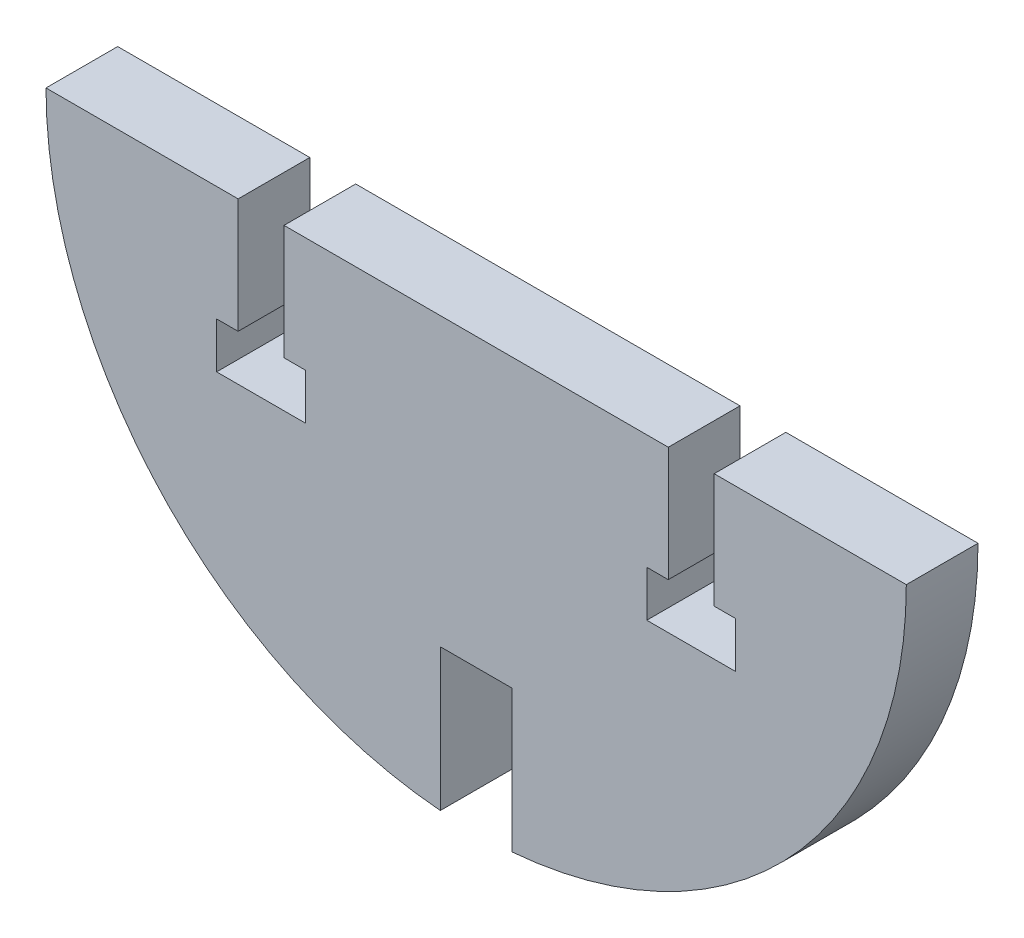
ISO-10303-21;
HEADER;
FILE_DESCRIPTION(('STEP AP214'),'2;1');
FILE_NAME('part.step','',(''),(''),'','','');
FILE_SCHEMA(('AUTOMOTIVE_DESIGN { 1 0 10303 214 1 1 1 1 }'));
ENDSEC;
DATA;
#1=APPLICATION_CONTEXT('core data for automotive mechanical design processes');
#2=APPLICATION_PROTOCOL_DEFINITION('international standard','automotive_design',2000,#1);
#3=PRODUCT_CONTEXT('',#1,'mechanical');
#4=PRODUCT('Part','Part','',(#3));
#5=PRODUCT_RELATED_PRODUCT_CATEGORY('part','',(#4));
#6=PRODUCT_DEFINITION_FORMATION('','',#4);
#7=PRODUCT_DEFINITION_CONTEXT('part definition',#1,'design');
#8=PRODUCT_DEFINITION('design','',#6,#7);
#9=PRODUCT_DEFINITION_SHAPE('','',#8);
#10=(LENGTH_UNIT() NAMED_UNIT(*) SI_UNIT(.MILLI.,.METRE.));
#11=(NAMED_UNIT(*) PLANE_ANGLE_UNIT() SI_UNIT($,.RADIAN.));
#12=(NAMED_UNIT(*) SI_UNIT($,.STERADIAN.) SOLID_ANGLE_UNIT());
#13=UNCERTAINTY_MEASURE_WITH_UNIT(LENGTH_MEASURE(1.E-05),#10,'distance_accuracy_value','');
#14=(GEOMETRIC_REPRESENTATION_CONTEXT(3) GLOBAL_UNCERTAINTY_ASSIGNED_CONTEXT((#13)) GLOBAL_UNIT_ASSIGNED_CONTEXT((#10,
#11,#12)) REPRESENTATION_CONTEXT('',''));
#15=CARTESIAN_POINT('',(0.,0.,0.));
#16=DIRECTION('',(0.,0.,1.));
#17=DIRECTION('',(1.,0.,0.));
#18=AXIS2_PLACEMENT_3D('',#15,#16,#17);
#19=CARTESIAN_POINT('',(-13.843,584.2,6.35));
#20=DIRECTION('',(1.,0.,0.));
#21=DIRECTION('',(0.,0.,-1.));
#22=AXIS2_PLACEMENT_3D('',#19,#20,#21);
#23=PLANE('',#22);
#24=DIRECTION('',(0.,-1.,0.));
#25=VECTOR('',#24,1.);
#26=CARTESIAN_POINT('',(-13.843,584.2,0.));
#27=LINE('',#26,#25);
#28=CARTESIAN_POINT('',(-13.843,584.2,0.));
#29=VERTEX_POINT('',#28);
#30=CARTESIAN_POINT('',(-13.843,574.04,0.));
#31=VERTEX_POINT('',#30);
#32=EDGE_CURVE('E214',#29,#31,#27,.T.);
#33=ORIENTED_EDGE('',*,*,#32,.T.);
#34=DIRECTION('',(0.,0.,-1.));
#35=VECTOR('',#34,1.);
#36=CARTESIAN_POINT('',(-13.843,574.04,6.35));
#37=LINE('',#36,#35);
#38=CARTESIAN_POINT('',(-13.843,574.04,6.35));
#39=VERTEX_POINT('',#38);
#40=EDGE_CURVE('E39',#39,#31,#37,.T.);
#41=ORIENTED_EDGE('',*,*,#40,.F.);
#42=DIRECTION('',(0.,-1.,0.));
#43=VECTOR('',#42,1.);
#44=CARTESIAN_POINT('',(-13.843,584.2,6.35));
#45=LINE('',#44,#43);
#46=CARTESIAN_POINT('',(-13.843,584.2,6.35));
#47=VERTEX_POINT('',#46);
#48=EDGE_CURVE('E133',#47,#39,#45,.T.);
#49=ORIENTED_EDGE('',*,*,#48,.F.);
#50=DIRECTION('',(0.,0.,-1.));
#51=VECTOR('',#50,1.);
#52=CARTESIAN_POINT('',(-13.843,584.2,6.35));
#53=LINE('',#52,#51);
#54=EDGE_CURVE('E11',#47,#29,#53,.T.);
#55=ORIENTED_EDGE('',*,*,#54,.T.);
#56=EDGE_LOOP('',(#33,#41,#49,#55));
#57=FACE_BOUND('',#56,.T.);
#58=ADVANCED_FACE('F31',(#57),#23,.F.);
#59=CARTESIAN_POINT('',(-13.843,574.04,6.35));
#60=DIRECTION('',(0.,1.,0.));
#61=DIRECTION('',(0.,0.,1.));
#62=AXIS2_PLACEMENT_3D('',#59,#60,#61);
#63=PLANE('',#62);
#64=DIRECTION('',(1.,0.,0.));
#65=VECTOR('',#64,1.);
#66=CARTESIAN_POINT('',(-13.843,574.04,0.));
#67=LINE('',#66,#65);
#68=CARTESIAN_POINT('',(-11.938,574.04,0.));
#69=VERTEX_POINT('',#68);
#70=EDGE_CURVE('E216',#31,#69,#67,.T.);
#71=ORIENTED_EDGE('',*,*,#70,.T.);
#72=DIRECTION('',(0.,0.,-1.));
#73=VECTOR('',#72,1.);
#74=CARTESIAN_POINT('',(-11.938,574.04,6.35));
#75=LINE('',#74,#73);
#76=CARTESIAN_POINT('',(-11.938,574.04,6.35));
#77=VERTEX_POINT('',#76);
#78=EDGE_CURVE('E307',#77,#69,#75,.T.);
#79=ORIENTED_EDGE('',*,*,#78,.F.);
#80=DIRECTION('',(1.,0.,0.));
#81=VECTOR('',#80,1.);
#82=CARTESIAN_POINT('',(-13.843,574.04,6.35));
#83=LINE('',#82,#81);
#84=EDGE_CURVE('E315',#39,#77,#83,.T.);
#85=ORIENTED_EDGE('',*,*,#84,.F.);
#86=ORIENTED_EDGE('',*,*,#40,.T.);
#87=EDGE_LOOP('',(#71,#79,#85,#86));
#88=FACE_BOUND('',#87,.T.);
#89=ADVANCED_FACE('F313',(#88),#63,.F.);
#90=CARTESIAN_POINT('',(-11.938,572.554033861209,6.35));
#91=DIRECTION('',(1.,0.,0.));
#92=DIRECTION('',(0.,0.,-1.));
#93=AXIS2_PLACEMENT_3D('',#90,#91,#92);
#94=PLANE('',#93);
#95=DIRECTION('',(0.,-1.,0.));
#96=VECTOR('',#95,1.);
#97=CARTESIAN_POINT('',(-11.938,572.554033861209,0.));
#98=LINE('',#97,#96);
#99=CARTESIAN_POINT('',(-11.938,569.976,0.));
#100=VERTEX_POINT('',#99);
#101=EDGE_CURVE('E219',#69,#100,#98,.T.);
#102=ORIENTED_EDGE('',*,*,#101,.T.);
#103=DIRECTION('',(0.,0.,-1.));
#104=VECTOR('',#103,1.);
#105=CARTESIAN_POINT('',(-11.938,569.976,6.35));
#106=LINE('',#105,#104);
#107=CARTESIAN_POINT('',(-11.938,569.976,6.35));
#108=VERTEX_POINT('',#107);
#109=EDGE_CURVE('E304',#108,#100,#106,.T.);
#110=ORIENTED_EDGE('',*,*,#109,.F.);
#111=DIRECTION('',(0.,-1.,0.));
#112=VECTOR('',#111,1.);
#113=CARTESIAN_POINT('',(-11.938,574.04,6.35));
#114=LINE('',#113,#112);
#115=EDGE_CURVE('E332',#77,#108,#114,.T.);
#116=ORIENTED_EDGE('',*,*,#115,.F.);
#117=ORIENTED_EDGE('',*,*,#78,.T.);
#118=EDGE_LOOP('',(#102,#110,#116,#117));
#119=FACE_BOUND('',#118,.T.);
#120=ADVANCED_FACE('F323',(#119),#94,.F.);
#121=CARTESIAN_POINT('',(-19.812,569.976,6.35));
#122=DIRECTION('',(0.,-1.,0.));
#123=DIRECTION('',(0.,0.,-1.));
#124=AXIS2_PLACEMENT_3D('',#121,#122,#123);
#125=PLANE('',#124);
#126=DIRECTION('',(-1.,0.,0.));
#127=VECTOR('',#126,1.);
#128=CARTESIAN_POINT('',(-19.812,569.976,0.));
#129=LINE('',#128,#127);
#130=CARTESIAN_POINT('',(-19.812,569.976,0.));
#131=VERTEX_POINT('',#130);
#132=EDGE_CURVE('E221',#100,#131,#129,.T.);
#133=ORIENTED_EDGE('',*,*,#132,.T.);
#134=DIRECTION('',(0.,0.,-1.));
#135=VECTOR('',#134,1.);
#136=CARTESIAN_POINT('',(-19.812,569.976,6.35));
#137=LINE('',#136,#135);
#138=CARTESIAN_POINT('',(-19.812,569.976,6.35));
#139=VERTEX_POINT('',#138);
#140=EDGE_CURVE('E301',#139,#131,#137,.T.);
#141=ORIENTED_EDGE('',*,*,#140,.F.);
#142=DIRECTION('',(-1.,0.,0.));
#143=VECTOR('',#142,1.);
#144=CARTESIAN_POINT('',(-19.812,569.976,6.35));
#145=LINE('',#144,#143);
#146=EDGE_CURVE('E329',#108,#139,#145,.T.);
#147=ORIENTED_EDGE('',*,*,#146,.F.);
#148=ORIENTED_EDGE('',*,*,#109,.T.);
#149=EDGE_LOOP('',(#133,#141,#147,#148));
#150=FACE_BOUND('',#149,.T.);
#151=ADVANCED_FACE('F327',(#150),#125,.F.);
#152=CARTESIAN_POINT('',(-19.812,574.04,6.35));
#153=DIRECTION('',(-1.,0.,0.));
#154=DIRECTION('',(0.,0.,1.));
#155=AXIS2_PLACEMENT_3D('',#152,#153,#154);
#156=PLANE('',#155);
#157=DIRECTION('',(0.,1.,0.));
#158=VECTOR('',#157,1.);
#159=CARTESIAN_POINT('',(-19.812,574.04,0.));
#160=LINE('',#159,#158);
#161=CARTESIAN_POINT('',(-19.812,574.04,0.));
#162=VERTEX_POINT('',#161);
#163=EDGE_CURVE('E224',#131,#162,#160,.T.);
#164=ORIENTED_EDGE('',*,*,#163,.T.);
#165=DIRECTION('',(0.,0.,-1.));
#166=VECTOR('',#165,1.);
#167=CARTESIAN_POINT('',(-19.812,574.04,6.35));
#168=LINE('',#167,#166);
#169=CARTESIAN_POINT('',(-19.812,574.04,6.35));
#170=VERTEX_POINT('',#169);
#171=EDGE_CURVE('E298',#170,#162,#168,.T.);
#172=ORIENTED_EDGE('',*,*,#171,.F.);
#173=DIRECTION('',(0.,1.,0.));
#174=VECTOR('',#173,1.);
#175=CARTESIAN_POINT('',(-19.812,572.554033861209,6.35));
#176=LINE('',#175,#174);
#177=EDGE_CURVE('E331',#139,#170,#176,.T.);
#178=ORIENTED_EDGE('',*,*,#177,.F.);
#179=ORIENTED_EDGE('',*,*,#140,.T.);
#180=EDGE_LOOP('',(#164,#172,#178,#179));
#181=FACE_BOUND('',#180,.T.);
#182=ADVANCED_FACE('F394',(#181),#156,.F.);
#183=CARTESIAN_POINT('',(-17.907,574.04,6.35));
#184=DIRECTION('',(0.,1.,0.));
#185=DIRECTION('',(0.,0.,1.));
#186=AXIS2_PLACEMENT_3D('',#183,#184,#185);
#187=PLANE('',#186);
#188=DIRECTION('',(1.,0.,0.));
#189=VECTOR('',#188,1.);
#190=CARTESIAN_POINT('',(-17.907,574.04,0.));
#191=LINE('',#190,#189);
#192=CARTESIAN_POINT('',(-17.907,574.04,0.));
#193=VERTEX_POINT('',#192);
#194=EDGE_CURVE('E226',#162,#193,#191,.T.);
#195=ORIENTED_EDGE('',*,*,#194,.T.);
#196=DIRECTION('',(0.,0.,-1.));
#197=VECTOR('',#196,1.);
#198=CARTESIAN_POINT('',(-17.907,574.04,6.35));
#199=LINE('',#198,#197);
#200=CARTESIAN_POINT('',(-17.907,574.04,6.35));
#201=VERTEX_POINT('',#200);
#202=EDGE_CURVE('E295',#201,#193,#199,.T.);
#203=ORIENTED_EDGE('',*,*,#202,.F.);
#204=DIRECTION('',(1.,0.,0.));
#205=VECTOR('',#204,1.);
#206=CARTESIAN_POINT('',(-17.907,574.04,6.35));
#207=LINE('',#206,#205);
#208=EDGE_CURVE('E334',#170,#201,#207,.T.);
#209=ORIENTED_EDGE('',*,*,#208,.F.);
#210=ORIENTED_EDGE('',*,*,#171,.T.);
#211=EDGE_LOOP('',(#195,#203,#209,#210));
#212=FACE_BOUND('',#211,.T.);
#213=ADVANCED_FACE('F397',(#212),#187,.F.);
#214=CARTESIAN_POINT('',(-17.907,584.2,6.35));
#215=DIRECTION('',(-1.,0.,0.));
#216=DIRECTION('',(0.,0.,1.));
#217=AXIS2_PLACEMENT_3D('',#214,#215,#216);
#218=PLANE('',#217);
#219=DIRECTION('',(0.,1.,0.));
#220=VECTOR('',#219,1.);
#221=CARTESIAN_POINT('',(-17.907,584.2,0.));
#222=LINE('',#221,#220);
#223=CARTESIAN_POINT('',(-17.907,584.2,0.));
#224=VERTEX_POINT('',#223);
#225=EDGE_CURVE('E228',#193,#224,#222,.T.);
#226=ORIENTED_EDGE('',*,*,#225,.T.);
#227=DIRECTION('',(0.,0.,-1.));
#228=VECTOR('',#227,1.);
#229=CARTESIAN_POINT('',(-17.907,584.2,6.35));
#230=LINE('',#229,#228);
#231=CARTESIAN_POINT('',(-17.907,584.2,6.35));
#232=VERTEX_POINT('',#231);
#233=EDGE_CURVE('E292',#232,#224,#230,.T.);
#234=ORIENTED_EDGE('',*,*,#233,.F.);
#235=DIRECTION('',(0.,1.,0.));
#236=VECTOR('',#235,1.);
#237=CARTESIAN_POINT('',(-17.907,584.2,6.35));
#238=LINE('',#237,#236);
#239=EDGE_CURVE('E340',#201,#232,#238,.T.);
#240=ORIENTED_EDGE('',*,*,#239,.F.);
#241=ORIENTED_EDGE('',*,*,#202,.T.);
#242=EDGE_LOOP('',(#226,#234,#240,#241));
#243=FACE_BOUND('',#242,.T.);
#244=ADVANCED_FACE('F401',(#243),#218,.F.);
#245=CARTESIAN_POINT('',(-17.907,584.2,6.35));
#246=DIRECTION('',(0.,-1.,0.));
#247=DIRECTION('',(0.,0.,-1.));
#248=AXIS2_PLACEMENT_3D('',#245,#246,#247);
#249=PLANE('',#248);
#250=DIRECTION('',(-1.,0.,0.));
#251=VECTOR('',#250,1.);
#252=CARTESIAN_POINT('',(-17.907,584.2,0.));
#253=LINE('',#252,#251);
#254=CARTESIAN_POINT('',(-34.925,584.2,0.));
#255=VERTEX_POINT('',#254);
#256=EDGE_CURVE('E230',#224,#255,#253,.T.);
#257=ORIENTED_EDGE('',*,*,#256,.T.);
#258=DIRECTION('',(0.,0.,-1.));
#259=VECTOR('',#258,1.);
#260=CARTESIAN_POINT('',(-34.925,584.2,6.35));
#261=LINE('',#260,#259);
#262=CARTESIAN_POINT('',(-34.925,584.2,6.35));
#263=VERTEX_POINT('',#262);
#264=EDGE_CURVE('E289',#263,#255,#261,.T.);
#265=ORIENTED_EDGE('',*,*,#264,.F.);
#266=DIRECTION('',(-1.,0.,0.));
#267=VECTOR('',#266,1.);
#268=CARTESIAN_POINT('',(-17.907,584.2,6.35));
#269=LINE('',#268,#267);
#270=EDGE_CURVE('E342',#232,#263,#269,.T.);
#271=ORIENTED_EDGE('',*,*,#270,.F.);
#272=ORIENTED_EDGE('',*,*,#233,.T.);
#273=EDGE_LOOP('',(#257,#265,#271,#272));
#274=FACE_BOUND('',#273,.T.);
#275=ADVANCED_FACE('F405',(#274),#249,.F.);
#276=CARTESIAN_POINT('',(3.17499999999997,584.2,6.35));
#277=DIRECTION('',(0.,0.,-1.));
#278=DIRECTION('',(-1.,0.,0.));
#279=AXIS2_PLACEMENT_3D('',#276,#277,#278);
#280=CYLINDRICAL_SURFACE('',#279,38.1);
#281=CARTESIAN_POINT('',(3.17499999999997,584.2,0.));
#282=DIRECTION('',(0.,0.,1.));
#283=DIRECTION('',(1.,0.,0.));
#284=AXIS2_PLACEMENT_3D('',#281,#282,#283);
#285=CIRCLE('',#284,38.1);
#286=CARTESIAN_POINT('',(0.,546.232522140653,0.));
#287=VERTEX_POINT('',#286);
#288=EDGE_CURVE('E232',#255,#287,#285,.T.);
#289=ORIENTED_EDGE('',*,*,#288,.T.);
#290=DIRECTION('',(0.,0.,-1.));
#291=VECTOR('',#290,1.);
#292=CARTESIAN_POINT('',(0.,546.232522140653,6.35));
#293=LINE('',#292,#291);
#294=CARTESIAN_POINT('',(0.,546.232522140653,6.35));
#295=VERTEX_POINT('',#294);
#296=EDGE_CURVE('E286',#295,#287,#293,.T.);
#297=ORIENTED_EDGE('',*,*,#296,.F.);
#298=CARTESIAN_POINT('',(3.17499999999997,584.2,6.35));
#299=DIRECTION('',(0.,0.,1.));
#300=DIRECTION('',(1.,0.,0.));
#301=AXIS2_PLACEMENT_3D('',#298,#299,#300);
#302=CIRCLE('',#301,38.1);
#303=EDGE_CURVE('E344',#263,#295,#302,.T.);
#304=ORIENTED_EDGE('',*,*,#303,.F.);
#305=ORIENTED_EDGE('',*,*,#264,.T.);
#306=EDGE_LOOP('',(#289,#297,#304,#305));
#307=FACE_BOUND('',#306,.T.);
#308=ADVANCED_FACE('F409',(#307),#280,.T.);
#309=CARTESIAN_POINT('',(0.,546.232522140653,6.35));
#310=DIRECTION('',(-1.,0.,0.));
#311=DIRECTION('',(0.,0.,1.));
#312=AXIS2_PLACEMENT_3D('',#309,#310,#311);
#313=PLANE('',#312);
#314=DIRECTION('',(0.,1.,0.));
#315=VECTOR('',#314,1.);
#316=CARTESIAN_POINT('',(0.,546.232522140653,0.));
#317=LINE('',#316,#315);
#318=CARTESIAN_POINT('',(0.,558.8,0.));
#319=VERTEX_POINT('',#318);
#320=EDGE_CURVE('E234',#287,#319,#317,.T.);
#321=ORIENTED_EDGE('',*,*,#320,.T.);
#322=DIRECTION('',(0.,0.,-1.));
#323=VECTOR('',#322,1.);
#324=CARTESIAN_POINT('',(0.,558.8,6.35));
#325=LINE('',#324,#323);
#326=CARTESIAN_POINT('',(0.,558.8,6.35));
#327=VERTEX_POINT('',#326);
#328=EDGE_CURVE('E283',#327,#319,#325,.T.);
#329=ORIENTED_EDGE('',*,*,#328,.F.);
#330=DIRECTION('',(0.,1.,0.));
#331=VECTOR('',#330,1.);
#332=CARTESIAN_POINT('',(0.,546.232522140653,6.35));
#333=LINE('',#332,#331);
#334=EDGE_CURVE('E346',#295,#327,#333,.T.);
#335=ORIENTED_EDGE('',*,*,#334,.F.);
#336=ORIENTED_EDGE('',*,*,#296,.T.);
#337=EDGE_LOOP('',(#321,#329,#335,#336));
#338=FACE_BOUND('',#337,.T.);
#339=ADVANCED_FACE('F413',(#338),#313,.F.);
#340=CARTESIAN_POINT('',(0.,558.8,6.35));
#341=DIRECTION('',(0.,1.,0.));
#342=DIRECTION('',(0.,0.,1.));
#343=AXIS2_PLACEMENT_3D('',#340,#341,#342);
#344=PLANE('',#343);
#345=DIRECTION('',(1.,0.,0.));
#346=VECTOR('',#345,1.);
#347=CARTESIAN_POINT('',(0.,558.8,0.));
#348=LINE('',#347,#346);
#349=CARTESIAN_POINT('',(6.34999999999997,558.8,0.));
#350=VERTEX_POINT('',#349);
#351=EDGE_CURVE('E236',#319,#350,#348,.T.);
#352=ORIENTED_EDGE('',*,*,#351,.T.);
#353=DIRECTION('',(0.,0.,-1.));
#354=VECTOR('',#353,1.);
#355=CARTESIAN_POINT('',(6.34999999999997,558.8,6.35));
#356=LINE('',#355,#354);
#357=CARTESIAN_POINT('',(6.34999999999997,558.8,6.35));
#358=VERTEX_POINT('',#357);
#359=EDGE_CURVE('E280',#358,#350,#356,.T.);
#360=ORIENTED_EDGE('',*,*,#359,.F.);
#361=DIRECTION('',(1.,0.,0.));
#362=VECTOR('',#361,1.);
#363=CARTESIAN_POINT('',(0.,558.8,6.35));
#364=LINE('',#363,#362);
#365=EDGE_CURVE('E348',#327,#358,#364,.T.);
#366=ORIENTED_EDGE('',*,*,#365,.F.);
#367=ORIENTED_EDGE('',*,*,#328,.T.);
#368=EDGE_LOOP('',(#352,#360,#366,#367));
#369=FACE_BOUND('',#368,.T.);
#370=ADVANCED_FACE('F417',(#369),#344,.F.);
#371=CARTESIAN_POINT('',(6.34999999999997,558.8,6.35));
#372=DIRECTION('',(1.,0.,0.));
#373=DIRECTION('',(0.,0.,-1.));
#374=AXIS2_PLACEMENT_3D('',#371,#372,#373);
#375=PLANE('',#374);
#376=DIRECTION('',(0.,-1.,0.));
#377=VECTOR('',#376,1.);
#378=CARTESIAN_POINT('',(6.34999999999997,558.8,0.));
#379=LINE('',#378,#377);
#380=CARTESIAN_POINT('',(6.34999999999998,546.232522140653,0.));
#381=VERTEX_POINT('',#380);
#382=EDGE_CURVE('E238',#350,#381,#379,.T.);
#383=ORIENTED_EDGE('',*,*,#382,.T.);
#384=DIRECTION('',(0.,0.,-1.));
#385=VECTOR('',#384,1.);
#386=CARTESIAN_POINT('',(6.34999999999998,546.232522140653,6.35));
#387=LINE('',#386,#385);
#388=CARTESIAN_POINT('',(6.34999999999998,546.232522140653,6.35));
#389=VERTEX_POINT('',#388);
#390=EDGE_CURVE('E277',#389,#381,#387,.T.);
#391=ORIENTED_EDGE('',*,*,#390,.F.);
#392=DIRECTION('',(0.,-1.,0.));
#393=VECTOR('',#392,1.);
#394=CARTESIAN_POINT('',(6.34999999999997,558.8,6.35));
#395=LINE('',#394,#393);
#396=EDGE_CURVE('E350',#358,#389,#395,.T.);
#397=ORIENTED_EDGE('',*,*,#396,.F.);
#398=ORIENTED_EDGE('',*,*,#359,.T.);
#399=EDGE_LOOP('',(#383,#391,#397,#398));
#400=FACE_BOUND('',#399,.T.);
#401=ADVANCED_FACE('F421',(#400),#375,.F.);
#402=CARTESIAN_POINT('',(3.17499999999997,584.2,6.35));
#403=DIRECTION('',(0.,0.,-1.));
#404=DIRECTION('',(-1.,0.,0.));
#405=AXIS2_PLACEMENT_3D('',#402,#403,#404);
#406=CYLINDRICAL_SURFACE('',#405,38.1);
#407=CARTESIAN_POINT('',(3.17499999999997,584.2,0.));
#408=DIRECTION('',(0.,0.,1.));
#409=DIRECTION('',(1.,0.,0.));
#410=AXIS2_PLACEMENT_3D('',#407,#408,#409);
#411=CIRCLE('',#410,38.1);
#412=CARTESIAN_POINT('',(41.275,584.2,0.));
#413=VERTEX_POINT('',#412);
#414=EDGE_CURVE('E240',#381,#413,#411,.T.);
#415=ORIENTED_EDGE('',*,*,#414,.T.);
#416=DIRECTION('',(0.,0.,-1.));
#417=VECTOR('',#416,1.);
#418=CARTESIAN_POINT('',(41.275,584.2,6.35));
#419=LINE('',#418,#417);
#420=CARTESIAN_POINT('',(41.275,584.2,6.35));
#421=VERTEX_POINT('',#420);
#422=EDGE_CURVE('E274',#421,#413,#419,.T.);
#423=ORIENTED_EDGE('',*,*,#422,.F.);
#424=CARTESIAN_POINT('',(3.17499999999997,584.2,6.35));
#425=DIRECTION('',(0.,0.,1.));
#426=DIRECTION('',(1.,0.,0.));
#427=AXIS2_PLACEMENT_3D('',#424,#425,#426);
#428=CIRCLE('',#427,38.1);
#429=EDGE_CURVE('E352',#389,#421,#428,.T.);
#430=ORIENTED_EDGE('',*,*,#429,.F.);
#431=ORIENTED_EDGE('',*,*,#390,.T.);
#432=EDGE_LOOP('',(#415,#423,#430,#431));
#433=FACE_BOUND('',#432,.T.);
#434=ADVANCED_FACE('F425',(#433),#406,.T.);
#435=CARTESIAN_POINT('',(24.257,584.2,6.35));
#436=DIRECTION('',(0.,-1.,0.));
#437=DIRECTION('',(0.,0.,-1.));
#438=AXIS2_PLACEMENT_3D('',#435,#436,#437);
#439=PLANE('',#438);
#440=DIRECTION('',(-1.,0.,0.));
#441=VECTOR('',#440,1.);
#442=CARTESIAN_POINT('',(24.257,584.2,0.));
#443=LINE('',#442,#441);
#444=CARTESIAN_POINT('',(24.257,584.2,0.));
#445=VERTEX_POINT('',#444);
#446=EDGE_CURVE('E242',#413,#445,#443,.T.);
#447=ORIENTED_EDGE('',*,*,#446,.T.);
#448=DIRECTION('',(0.,0.,-1.));
#449=VECTOR('',#448,1.);
#450=CARTESIAN_POINT('',(24.257,584.2,6.35));
#451=LINE('',#450,#449);
#452=CARTESIAN_POINT('',(24.257,584.2,6.35));
#453=VERTEX_POINT('',#452);
#454=EDGE_CURVE('E271',#453,#445,#451,.T.);
#455=ORIENTED_EDGE('',*,*,#454,.F.);
#456=DIRECTION('',(-1.,0.,0.));
#457=VECTOR('',#456,1.);
#458=CARTESIAN_POINT('',(24.257,584.2,6.35));
#459=LINE('',#458,#457);
#460=EDGE_CURVE('E354',#421,#453,#459,.T.);
#461=ORIENTED_EDGE('',*,*,#460,.F.);
#462=ORIENTED_EDGE('',*,*,#422,.T.);
#463=EDGE_LOOP('',(#447,#455,#461,#462));
#464=FACE_BOUND('',#463,.T.);
#465=ADVANCED_FACE('F429',(#464),#439,.F.);
#466=CARTESIAN_POINT('',(24.257,584.2,6.35));
#467=DIRECTION('',(1.,0.,0.));
#468=DIRECTION('',(0.,0.,-1.));
#469=AXIS2_PLACEMENT_3D('',#466,#467,#468);
#470=PLANE('',#469);
#471=DIRECTION('',(0.,-1.,0.));
#472=VECTOR('',#471,1.);
#473=CARTESIAN_POINT('',(24.257,584.2,0.));
#474=LINE('',#473,#472);
#475=CARTESIAN_POINT('',(24.257,574.04,0.));
#476=VERTEX_POINT('',#475);
#477=EDGE_CURVE('E244',#445,#476,#474,.T.);
#478=ORIENTED_EDGE('',*,*,#477,.T.);
#479=DIRECTION('',(0.,0.,-1.));
#480=VECTOR('',#479,1.);
#481=CARTESIAN_POINT('',(24.257,574.04,6.35));
#482=LINE('',#481,#480);
#483=CARTESIAN_POINT('',(24.257,574.04,6.35));
#484=VERTEX_POINT('',#483);
#485=EDGE_CURVE('E268',#484,#476,#482,.T.);
#486=ORIENTED_EDGE('',*,*,#485,.F.);
#487=DIRECTION('',(0.,-1.,0.));
#488=VECTOR('',#487,1.);
#489=CARTESIAN_POINT('',(24.257,584.2,6.35));
#490=LINE('',#489,#488);
#491=EDGE_CURVE('E356',#453,#484,#490,.T.);
#492=ORIENTED_EDGE('',*,*,#491,.F.);
#493=ORIENTED_EDGE('',*,*,#454,.T.);
#494=EDGE_LOOP('',(#478,#486,#492,#493));
#495=FACE_BOUND('',#494,.T.);
#496=ADVANCED_FACE('F433',(#495),#470,.F.);
#497=CARTESIAN_POINT('',(24.257,574.04,6.35));
#498=DIRECTION('',(0.,1.,0.));
#499=DIRECTION('',(0.,0.,1.));
#500=AXIS2_PLACEMENT_3D('',#497,#498,#499);
#501=PLANE('',#500);
#502=DIRECTION('',(1.,0.,0.));
#503=VECTOR('',#502,1.);
#504=CARTESIAN_POINT('',(24.257,574.04,0.));
#505=LINE('',#504,#503);
#506=CARTESIAN_POINT('',(26.162,574.04,0.));
#507=VERTEX_POINT('',#506);
#508=EDGE_CURVE('E246',#476,#507,#505,.T.);
#509=ORIENTED_EDGE('',*,*,#508,.T.);
#510=DIRECTION('',(0.,0.,-1.));
#511=VECTOR('',#510,1.);
#512=CARTESIAN_POINT('',(26.162,574.04,6.35));
#513=LINE('',#512,#511);
#514=CARTESIAN_POINT('',(26.162,574.04,6.35));
#515=VERTEX_POINT('',#514);
#516=EDGE_CURVE('E265',#515,#507,#513,.T.);
#517=ORIENTED_EDGE('',*,*,#516,.F.);
#518=DIRECTION('',(1.,0.,0.));
#519=VECTOR('',#518,1.);
#520=CARTESIAN_POINT('',(24.257,574.04,6.35));
#521=LINE('',#520,#519);
#522=EDGE_CURVE('E358',#484,#515,#521,.T.);
#523=ORIENTED_EDGE('',*,*,#522,.F.);
#524=ORIENTED_EDGE('',*,*,#485,.T.);
#525=EDGE_LOOP('',(#509,#517,#523,#524));
#526=FACE_BOUND('',#525,.T.);
#527=ADVANCED_FACE('F437',(#526),#501,.F.);
#528=CARTESIAN_POINT('',(26.162,572.554033861209,6.35));
#529=DIRECTION('',(1.,0.,0.));
#530=DIRECTION('',(0.,0.,-1.));
#531=AXIS2_PLACEMENT_3D('',#528,#529,#530);
#532=PLANE('',#531);
#533=DIRECTION('',(0.,-1.,0.));
#534=VECTOR('',#533,1.);
#535=CARTESIAN_POINT('',(26.162,572.554033861209,0.));
#536=LINE('',#535,#534);
#537=CARTESIAN_POINT('',(26.162,569.976,0.));
#538=VERTEX_POINT('',#537);
#539=EDGE_CURVE('E249',#507,#538,#536,.T.);
#540=ORIENTED_EDGE('',*,*,#539,.T.);
#541=DIRECTION('',(0.,0.,-1.));
#542=VECTOR('',#541,1.);
#543=CARTESIAN_POINT('',(26.162,569.976,6.35));
#544=LINE('',#543,#542);
#545=CARTESIAN_POINT('',(26.162,569.976,6.35));
#546=VERTEX_POINT('',#545);
#547=EDGE_CURVE('E262',#546,#538,#544,.T.);
#548=ORIENTED_EDGE('',*,*,#547,.F.);
#549=DIRECTION('',(0.,-1.,0.));
#550=VECTOR('',#549,1.);
#551=CARTESIAN_POINT('',(26.162,574.04,6.35));
#552=LINE('',#551,#550);
#553=EDGE_CURVE('E360',#515,#546,#552,.T.);
#554=ORIENTED_EDGE('',*,*,#553,.F.);
#555=ORIENTED_EDGE('',*,*,#516,.T.);
#556=EDGE_LOOP('',(#540,#548,#554,#555));
#557=FACE_BOUND('',#556,.T.);
#558=ADVANCED_FACE('F366',(#557),#532,.F.);
#559=CARTESIAN_POINT('',(26.162,569.976,6.35));
#560=DIRECTION('',(0.,-1.,0.));
#561=DIRECTION('',(0.,0.,-1.));
#562=AXIS2_PLACEMENT_3D('',#559,#560,#561);
#563=PLANE('',#562);
#564=DIRECTION('',(-1.,0.,0.));
#565=VECTOR('',#564,1.);
#566=CARTESIAN_POINT('',(26.162,569.976,0.));
#567=LINE('',#566,#565);
#568=CARTESIAN_POINT('',(18.288,569.976,0.));
#569=VERTEX_POINT('',#568);
#570=EDGE_CURVE('E251',#538,#569,#567,.T.);
#571=ORIENTED_EDGE('',*,*,#570,.T.);
#572=DIRECTION('',(0.,0.,-1.));
#573=VECTOR('',#572,1.);
#574=CARTESIAN_POINT('',(18.288,569.976,6.35));
#575=LINE('',#574,#573);
#576=CARTESIAN_POINT('',(18.288,569.976,6.35));
#577=VERTEX_POINT('',#576);
#578=EDGE_CURVE('E203',#577,#569,#575,.T.);
#579=ORIENTED_EDGE('',*,*,#578,.F.);
#580=DIRECTION('',(-1.,0.,0.));
#581=VECTOR('',#580,1.);
#582=CARTESIAN_POINT('',(26.162,569.976,6.35));
#583=LINE('',#582,#581);
#584=EDGE_CURVE('E195',#546,#577,#583,.T.);
#585=ORIENTED_EDGE('',*,*,#584,.F.);
#586=ORIENTED_EDGE('',*,*,#547,.T.);
#587=EDGE_LOOP('',(#571,#579,#585,#586));
#588=FACE_BOUND('',#587,.T.);
#589=ADVANCED_FACE('F369',(#588),#563,.F.);
#590=CARTESIAN_POINT('',(18.288,574.04,6.35));
#591=DIRECTION('',(-1.,0.,0.));
#592=DIRECTION('',(0.,0.,1.));
#593=AXIS2_PLACEMENT_3D('',#590,#591,#592);
#594=PLANE('',#593);
#595=DIRECTION('',(0.,1.,0.));
#596=VECTOR('',#595,1.);
#597=CARTESIAN_POINT('',(18.288,574.04,0.));
#598=LINE('',#597,#596);
#599=CARTESIAN_POINT('',(18.288,574.04,0.));
#600=VERTEX_POINT('',#599);
#601=EDGE_CURVE('E202',#569,#600,#598,.T.);
#602=ORIENTED_EDGE('',*,*,#601,.T.);
#603=DIRECTION('',(0.,0.,-1.));
#604=VECTOR('',#603,1.);
#605=CARTESIAN_POINT('',(18.288,574.04,6.35));
#606=LINE('',#605,#604);
#607=CARTESIAN_POINT('',(18.288,574.04,6.35));
#608=VERTEX_POINT('',#607);
#609=EDGE_CURVE('E200',#608,#600,#606,.T.);
#610=ORIENTED_EDGE('',*,*,#609,.F.);
#611=DIRECTION('',(0.,1.,0.));
#612=VECTOR('',#611,1.);
#613=CARTESIAN_POINT('',(18.288,572.554033861209,6.35));
#614=LINE('',#613,#612);
#615=EDGE_CURVE('E189',#577,#608,#614,.T.);
#616=ORIENTED_EDGE('',*,*,#615,.F.);
#617=ORIENTED_EDGE('',*,*,#578,.T.);
#618=EDGE_LOOP('',(#602,#610,#616,#617));
#619=FACE_BOUND('',#618,.T.);
#620=ADVANCED_FACE('F201',(#619),#594,.F.);
#621=CARTESIAN_POINT('',(20.193,574.04,6.35));
#622=DIRECTION('',(0.,1.,0.));
#623=DIRECTION('',(0.,0.,1.));
#624=AXIS2_PLACEMENT_3D('',#621,#622,#623);
#625=PLANE('',#624);
#626=DIRECTION('',(1.,0.,0.));
#627=VECTOR('',#626,1.);
#628=CARTESIAN_POINT('',(20.193,574.04,0.));
#629=LINE('',#628,#627);
#630=CARTESIAN_POINT('',(20.193,574.04,0.));
#631=VERTEX_POINT('',#630);
#632=EDGE_CURVE('E119',#600,#631,#629,.T.);
#633=ORIENTED_EDGE('',*,*,#632,.T.);
#634=DIRECTION('',(0.,0.,-1.));
#635=VECTOR('',#634,1.);
#636=CARTESIAN_POINT('',(20.193,574.04,6.35));
#637=LINE('',#636,#635);
#638=CARTESIAN_POINT('',(20.193,574.04,6.35));
#639=VERTEX_POINT('',#638);
#640=EDGE_CURVE('E204',#639,#631,#637,.T.);
#641=ORIENTED_EDGE('',*,*,#640,.F.);
#642=DIRECTION('',(1.,0.,0.));
#643=VECTOR('',#642,1.);
#644=CARTESIAN_POINT('',(20.193,574.04,6.35));
#645=LINE('',#644,#643);
#646=EDGE_CURVE('E193',#608,#639,#645,.T.);
#647=ORIENTED_EDGE('',*,*,#646,.F.);
#648=ORIENTED_EDGE('',*,*,#609,.T.);
#649=EDGE_LOOP('',(#633,#641,#647,#648));
#650=FACE_BOUND('',#649,.T.);
#651=ADVANCED_FACE('F206',(#650),#625,.F.);
#652=CARTESIAN_POINT('',(20.193,584.2,6.35));
#653=DIRECTION('',(-1.,0.,0.));
#654=DIRECTION('',(0.,0.,1.));
#655=AXIS2_PLACEMENT_3D('',#652,#653,#654);
#656=PLANE('',#655);
#657=DIRECTION('',(0.,1.,0.));
#658=VECTOR('',#657,1.);
#659=CARTESIAN_POINT('',(20.193,584.2,0.));
#660=LINE('',#659,#658);
#661=CARTESIAN_POINT('',(20.193,584.2,0.));
#662=VERTEX_POINT('',#661);
#663=EDGE_CURVE('E126',#631,#662,#660,.T.);
#664=ORIENTED_EDGE('',*,*,#663,.T.);
#665=DIRECTION('',(0.,0.,-1.));
#666=VECTOR('',#665,1.);
#667=CARTESIAN_POINT('',(20.193,584.2,6.35));
#668=LINE('',#667,#666);
#669=CARTESIAN_POINT('',(20.193,584.2,6.35));
#670=VERTEX_POINT('',#669);
#671=EDGE_CURVE('E210',#670,#662,#668,.T.);
#672=ORIENTED_EDGE('',*,*,#671,.F.);
#673=DIRECTION('',(0.,1.,0.));
#674=VECTOR('',#673,1.);
#675=CARTESIAN_POINT('',(20.193,584.2,6.35));
#676=LINE('',#675,#674);
#677=EDGE_CURVE('E208',#639,#670,#676,.T.);
#678=ORIENTED_EDGE('',*,*,#677,.F.);
#679=ORIENTED_EDGE('',*,*,#640,.T.);
#680=EDGE_LOOP('',(#664,#672,#678,#679));
#681=FACE_BOUND('',#680,.T.);
#682=ADVANCED_FACE('F372',(#681),#656,.F.);
#683=CARTESIAN_POINT('',(3.17499999999997,584.2,6.35));
#684=DIRECTION('',(0.,-1.,0.));
#685=DIRECTION('',(0.,0.,-1.));
#686=AXIS2_PLACEMENT_3D('',#683,#684,#685);
#687=PLANE('',#686);
#688=DIRECTION('',(-1.,0.,0.));
#689=VECTOR('',#688,1.);
#690=CARTESIAN_POINT('',(3.17499999999997,584.2,0.));
#691=LINE('',#690,#689);
#692=EDGE_CURVE('E257',#662,#29,#691,.T.);
#693=ORIENTED_EDGE('',*,*,#692,.T.);
#694=ORIENTED_EDGE('',*,*,#54,.F.);
#695=DIRECTION('',(-1.,0.,0.));
#696=VECTOR('',#695,1.);
#697=CARTESIAN_POINT('',(3.17499999999997,584.2,6.35));
#698=LINE('',#697,#696);
#699=EDGE_CURVE('E47',#670,#47,#698,.T.);
#700=ORIENTED_EDGE('',*,*,#699,.F.);
#701=ORIENTED_EDGE('',*,*,#671,.T.);
#702=EDGE_LOOP('',(#693,#694,#700,#701));
#703=FACE_BOUND('',#702,.T.);
#704=ADVANCED_FACE('F371',(#703),#687,.F.);
#705=CARTESIAN_POINT('',(3.17499999999997,584.2,6.35));
#706=DIRECTION('',(0.,0.,1.));
#707=DIRECTION('',(1.,0.,0.));
#708=AXIS2_PLACEMENT_3D('',#705,#706,#707);
#709=PLANE('',#708);
#710=ORIENTED_EDGE('',*,*,#699,.T.);
#711=ORIENTED_EDGE('',*,*,#48,.T.);
#712=ORIENTED_EDGE('',*,*,#84,.T.);
#713=ORIENTED_EDGE('',*,*,#115,.T.);
#714=ORIENTED_EDGE('',*,*,#146,.T.);
#715=ORIENTED_EDGE('',*,*,#177,.T.);
#716=ORIENTED_EDGE('',*,*,#208,.T.);
#717=ORIENTED_EDGE('',*,*,#239,.T.);
#718=ORIENTED_EDGE('',*,*,#270,.T.);
#719=ORIENTED_EDGE('',*,*,#303,.T.);
#720=ORIENTED_EDGE('',*,*,#334,.T.);
#721=ORIENTED_EDGE('',*,*,#365,.T.);
#722=ORIENTED_EDGE('',*,*,#396,.T.);
#723=ORIENTED_EDGE('',*,*,#429,.T.);
#724=ORIENTED_EDGE('',*,*,#460,.T.);
#725=ORIENTED_EDGE('',*,*,#491,.T.);
#726=ORIENTED_EDGE('',*,*,#522,.T.);
#727=ORIENTED_EDGE('',*,*,#553,.T.);
#728=ORIENTED_EDGE('',*,*,#584,.T.);
#729=ORIENTED_EDGE('',*,*,#615,.T.);
#730=ORIENTED_EDGE('',*,*,#646,.T.);
#731=ORIENTED_EDGE('',*,*,#677,.T.);
#732=EDGE_LOOP('',(#710,#711,#712,#713,#714,#715,#716,#717,#718,#719,#720,#721,#722,#723,#724,
#725,#726,#727,#728,#729,#730,#731));
#733=FACE_BOUND('',#732,.T.);
#734=ADVANCED_FACE('F191',(#733),#709,.T.);
#735=CARTESIAN_POINT('',(3.17499999999997,584.2,0.));
#736=DIRECTION('',(0.,0.,1.));
#737=DIRECTION('',(1.,0.,0.));
#738=AXIS2_PLACEMENT_3D('',#735,#736,#737);
#739=PLANE('',#738);
#740=ORIENTED_EDGE('',*,*,#32,.F.);
#741=ORIENTED_EDGE('',*,*,#692,.F.);
#742=ORIENTED_EDGE('',*,*,#663,.F.);
#743=ORIENTED_EDGE('',*,*,#632,.F.);
#744=ORIENTED_EDGE('',*,*,#601,.F.);
#745=ORIENTED_EDGE('',*,*,#570,.F.);
#746=ORIENTED_EDGE('',*,*,#539,.F.);
#747=ORIENTED_EDGE('',*,*,#508,.F.);
#748=ORIENTED_EDGE('',*,*,#477,.F.);
#749=ORIENTED_EDGE('',*,*,#446,.F.);
#750=ORIENTED_EDGE('',*,*,#414,.F.);
#751=ORIENTED_EDGE('',*,*,#382,.F.);
#752=ORIENTED_EDGE('',*,*,#351,.F.);
#753=ORIENTED_EDGE('',*,*,#320,.F.);
#754=ORIENTED_EDGE('',*,*,#288,.F.);
#755=ORIENTED_EDGE('',*,*,#256,.F.);
#756=ORIENTED_EDGE('',*,*,#225,.F.);
#757=ORIENTED_EDGE('',*,*,#194,.F.);
#758=ORIENTED_EDGE('',*,*,#163,.F.);
#759=ORIENTED_EDGE('',*,*,#132,.F.);
#760=ORIENTED_EDGE('',*,*,#101,.F.);
#761=ORIENTED_EDGE('',*,*,#70,.F.);
#762=EDGE_LOOP('',(#740,#741,#742,#743,#744,#745,#746,#747,#748,#749,#750,#751,#752,#753,#754,
#755,#756,#757,#758,#759,#760,#761));
#763=FACE_BOUND('',#762,.T.);
#764=ADVANCED_FACE('F318',(#763),#739,.F.);
#765=CLOSED_SHELL('',(#58,#89,#120,#151,#182,#213,#244,#275,#308,#339,#370,#401,#434,#465,#496,
#527,#558,#589,#620,#651,#682,#704,#734,#764));
#766=MANIFOLD_SOLID_BREP('B2',#765);
#767=ADVANCED_BREP_SHAPE_REPRESENTATION('',(#18,#766),#14);
#768=SHAPE_DEFINITION_REPRESENTATION(#9,#767);
ENDSEC;
END-ISO-10303-21;
